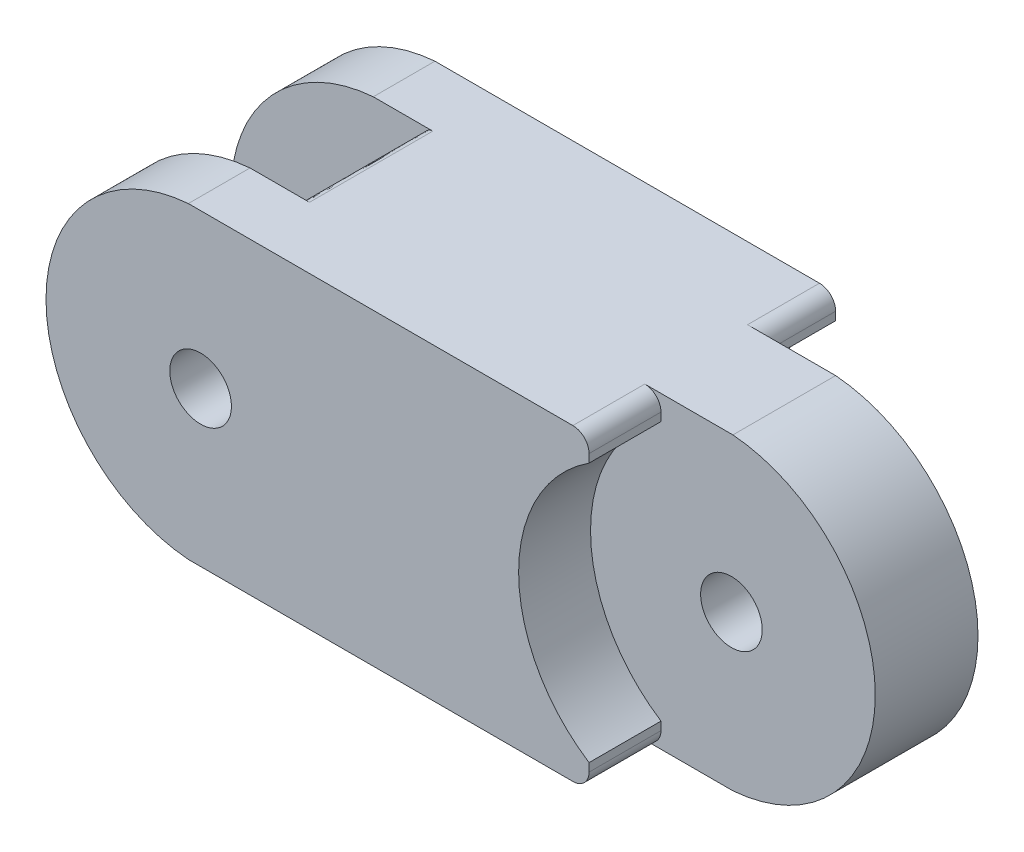
ISO-10303-21;
HEADER;
FILE_DESCRIPTION(('STEP AP214'),'2;1');
FILE_NAME('part.step','',(''),(''),'','','');
FILE_SCHEMA(('AUTOMOTIVE_DESIGN { 1 0 10303 214 1 1 1 1 }'));
ENDSEC;
DATA;
#1=APPLICATION_CONTEXT('core data for automotive mechanical design processes');
#2=APPLICATION_PROTOCOL_DEFINITION('international standard','automotive_design',2000,#1);
#3=PRODUCT_CONTEXT('',#1,'mechanical');
#4=PRODUCT('Part','Part','',(#3));
#5=PRODUCT_RELATED_PRODUCT_CATEGORY('part','',(#4));
#6=PRODUCT_DEFINITION_FORMATION('','',#4);
#7=PRODUCT_DEFINITION_CONTEXT('part definition',#1,'design');
#8=PRODUCT_DEFINITION('design','',#6,#7);
#9=PRODUCT_DEFINITION_SHAPE('','',#8);
#10=(LENGTH_UNIT() NAMED_UNIT(*) SI_UNIT(.MILLI.,.METRE.));
#11=(NAMED_UNIT(*) PLANE_ANGLE_UNIT() SI_UNIT($,.RADIAN.));
#12=(NAMED_UNIT(*) SI_UNIT($,.STERADIAN.) SOLID_ANGLE_UNIT());
#13=UNCERTAINTY_MEASURE_WITH_UNIT(LENGTH_MEASURE(1.E-05),#10,'distance_accuracy_value','');
#14=(GEOMETRIC_REPRESENTATION_CONTEXT(3) GLOBAL_UNCERTAINTY_ASSIGNED_CONTEXT((#13)) GLOBAL_UNIT_ASSIGNED_CONTEXT((#10,
#11,#12)) REPRESENTATION_CONTEXT('',''));
#15=CARTESIAN_POINT('',(0.,0.,0.));
#16=DIRECTION('',(0.,0.,1.));
#17=DIRECTION('',(1.,0.,0.));
#18=AXIS2_PLACEMENT_3D('',#15,#16,#17);
#19=CARTESIAN_POINT('',(-13.8483301079063,9.525,-7.62));
#20=DIRECTION('',(0.,0.,1.));
#21=DIRECTION('',(1.,0.,0.));
#22=AXIS2_PLACEMENT_3D('',#19,#20,#21);
#23=CYLINDRICAL_SURFACE('',#22,1.905);
#24=CARTESIAN_POINT('',(-13.8483301079063,9.525,7.62));
#25=DIRECTION('',(0.,0.,1.));
#26=DIRECTION('',(1.,0.,0.));
#27=AXIS2_PLACEMENT_3D('',#24,#25,#26);
#28=CIRCLE('',#27,1.905);
#29=CARTESIAN_POINT('',(-11.9433301079063,9.525,7.62));
#30=VERTEX_POINT('',#29);
#31=EDGE_CURVE('E646',#30,#30,#28,.T.);
#32=ORIENTED_EDGE('',*,*,#31,.T.);
#33=EDGE_LOOP('',(#32));
#34=FACE_BOUND('',#33,.T.);
#35=CARTESIAN_POINT('',(-13.8483301079063,9.525,3.81));
#36=DIRECTION('',(0.,0.,1.));
#37=DIRECTION('',(1.,0.,0.));
#38=AXIS2_PLACEMENT_3D('',#35,#36,#37);
#39=CIRCLE('',#38,1.905);
#40=CARTESIAN_POINT('',(-11.9433301079063,9.525,3.81));
#41=VERTEX_POINT('',#40);
#42=EDGE_CURVE('E444',#41,#41,#39,.T.);
#43=ORIENTED_EDGE('',*,*,#42,.F.);
#44=EDGE_LOOP('',(#43));
#45=FACE_BOUND('',#44,.T.);
#46=ADVANCED_FACE('F45',(#34,#45),#23,.F.);
#47=CARTESIAN_POINT('',(-14.605,19.05,-7.62));
#48=DIRECTION('',(0.,0.,-1.));
#49=DIRECTION('',(-1.,0.,0.));
#50=AXIS2_PLACEMENT_3D('',#47,#48,#49);
#51=PLANE('',#50);
#52=DIRECTION('',(0.,1.,0.));
#53=VECTOR('',#52,1.);
#54=CARTESIAN_POINT('',(10.16,-6.28617928474841,-7.62));
#55=LINE('',#54,#53);
#56=CARTESIAN_POINT('',(10.16,1.,-7.62));
#57=VERTEX_POINT('',#56);
#58=CARTESIAN_POINT('',(10.16,1.50996383917781,-7.62));
#59=VERTEX_POINT('',#58);
#60=EDGE_CURVE('E374',#57,#59,#55,.T.);
#61=ORIENTED_EDGE('',*,*,#60,.F.);
#62=CARTESIAN_POINT('',(9.16,1.,-7.62));
#63=DIRECTION('',(0.,0.,-1.));
#64=DIRECTION('',(-1.,0.,0.));
#65=AXIS2_PLACEMENT_3D('',#62,#63,#64);
#66=CIRCLE('',#65,1.);
#67=CARTESIAN_POINT('',(9.15999999999999,0.,-7.62));
#68=VERTEX_POINT('',#67);
#69=EDGE_CURVE('E402',#57,#68,#66,.T.);
#70=ORIENTED_EDGE('',*,*,#69,.T.);
#71=DIRECTION('',(1.,0.,0.));
#72=VECTOR('',#71,1.);
#73=CARTESIAN_POINT('',(-14.605,0.,-7.62));
#74=LINE('',#73,#72);
#75=CARTESIAN_POINT('',(-14.605,0.,-7.62));
#76=VERTEX_POINT('',#75);
#77=EDGE_CURVE('E235',#76,#68,#74,.T.);
#78=ORIENTED_EDGE('',*,*,#77,.F.);
#79=CARTESIAN_POINT('',(-13.8483301079063,9.525,-7.62));
#80=DIRECTION('',(0.,0.,1.));
#81=DIRECTION('',(1.,0.,0.));
#82=AXIS2_PLACEMENT_3D('',#79,#80,#81);
#83=CIRCLE('',#82,9.555007814);
#84=CARTESIAN_POINT('',(-14.605,19.05,-7.62));
#85=VERTEX_POINT('',#84);
#86=EDGE_CURVE('E434',#85,#76,#83,.T.);
#87=ORIENTED_EDGE('',*,*,#86,.F.);
#88=DIRECTION('',(1.,0.,0.));
#89=VECTOR('',#88,1.);
#90=CARTESIAN_POINT('',(-14.605,19.05,-7.62));
#91=LINE('',#90,#89);
#92=CARTESIAN_POINT('',(9.15999999999999,19.05,-7.62));
#93=VERTEX_POINT('',#92);
#94=EDGE_CURVE('E226',#85,#93,#91,.T.);
#95=ORIENTED_EDGE('',*,*,#94,.T.);
#96=CARTESIAN_POINT('',(9.16,18.05,-7.62));
#97=DIRECTION('',(0.,0.,-1.));
#98=DIRECTION('',(-1.,0.,0.));
#99=AXIS2_PLACEMENT_3D('',#96,#97,#98);
#100=CIRCLE('',#99,1.);
#101=CARTESIAN_POINT('',(10.16,18.05,-7.62));
#102=VERTEX_POINT('',#101);
#103=EDGE_CURVE('E400',#93,#102,#100,.T.);
#104=ORIENTED_EDGE('',*,*,#103,.T.);
#105=CARTESIAN_POINT('',(10.16,17.5400361608222,-7.62));
#106=VERTEX_POINT('',#105);
#107=EDGE_CURVE('E480',#106,#102,#55,.T.);
#108=ORIENTED_EDGE('',*,*,#107,.F.);
#109=CARTESIAN_POINT('',(15.3616698920937,9.525,-7.62));
#110=DIRECTION('',(0.,0.,-1.));
#111=DIRECTION('',(-1.,0.,0.));
#112=AXIS2_PLACEMENT_3D('',#109,#110,#111);
#113=CIRCLE('',#112,9.555007814);
#114=EDGE_CURVE('E651',#106,#59,#113,.F.);
#115=ORIENTED_EDGE('',*,*,#114,.T.);
#116=EDGE_LOOP('',(#61,#70,#78,#87,#95,#104,#108,#115));
#117=FACE_BOUND('',#116,.T.);
#118=CARTESIAN_POINT('',(-13.8483301079063,9.525,-7.62));
#119=DIRECTION('',(0.,0.,1.));
#120=DIRECTION('',(1.,0.,0.));
#121=AXIS2_PLACEMENT_3D('',#118,#119,#120);
#122=CIRCLE('',#121,1.905);
#123=CARTESIAN_POINT('',(-11.9433301079063,9.525,-7.62));
#124=VERTEX_POINT('',#123);
#125=EDGE_CURVE('E631',#124,#124,#122,.T.);
#126=ORIENTED_EDGE('',*,*,#125,.T.);
#127=EDGE_LOOP('',(#126));
#128=FACE_BOUND('',#127,.T.);
#129=ADVANCED_FACE('F269',(#117,#128),#51,.T.);
#130=CARTESIAN_POINT('',(-14.605,19.05,7.62));
#131=DIRECTION('',(0.,0.,-1.));
#132=DIRECTION('',(-1.,0.,0.));
#133=AXIS2_PLACEMENT_3D('',#130,#131,#132);
#134=PLANE('',#133);
#135=ORIENTED_EDGE('',*,*,#31,.F.);
#136=EDGE_LOOP('',(#135));
#137=FACE_BOUND('',#136,.T.);
#138=DIRECTION('',(1.,0.,0.));
#139=VECTOR('',#138,1.);
#140=CARTESIAN_POINT('',(-14.605,0.,7.62));
#141=LINE('',#140,#139);
#142=CARTESIAN_POINT('',(-14.605,0.,7.62));
#143=VERTEX_POINT('',#142);
#144=CARTESIAN_POINT('',(9.15999999999999,0.,7.62));
#145=VERTEX_POINT('',#144);
#146=EDGE_CURVE('E227',#143,#145,#141,.T.);
#147=ORIENTED_EDGE('',*,*,#146,.T.);
#148=CARTESIAN_POINT('',(9.16,1.,7.62));
#149=DIRECTION('',(0.,0.,-1.));
#150=DIRECTION('',(-1.,0.,0.));
#151=AXIS2_PLACEMENT_3D('',#148,#149,#150);
#152=CIRCLE('',#151,1.);
#153=CARTESIAN_POINT('',(10.16,1.,7.62));
#154=VERTEX_POINT('',#153);
#155=EDGE_CURVE('E394',#145,#154,#152,.F.);
#156=ORIENTED_EDGE('',*,*,#155,.T.);
#157=DIRECTION('',(0.,1.,0.));
#158=VECTOR('',#157,1.);
#159=CARTESIAN_POINT('',(10.16,-6.28617928474841,7.62));
#160=LINE('',#159,#158);
#161=CARTESIAN_POINT('',(10.16,1.50996383917781,7.62));
#162=VERTEX_POINT('',#161);
#163=EDGE_CURVE('E464',#154,#162,#160,.T.);
#164=ORIENTED_EDGE('',*,*,#163,.T.);
#165=CARTESIAN_POINT('',(15.3616698920937,9.525,7.62));
#166=DIRECTION('',(0.,0.,-1.));
#167=DIRECTION('',(-1.,0.,0.));
#168=AXIS2_PLACEMENT_3D('',#165,#166,#167);
#169=CIRCLE('',#168,9.555007814);
#170=CARTESIAN_POINT('',(10.16,17.5400361608222,7.62));
#171=VERTEX_POINT('',#170);
#172=EDGE_CURVE('E645',#162,#171,#169,.T.);
#173=ORIENTED_EDGE('',*,*,#172,.T.);
#174=CARTESIAN_POINT('',(10.16,18.05,7.62));
#175=VERTEX_POINT('',#174);
#176=EDGE_CURVE('E199',#171,#175,#160,.T.);
#177=ORIENTED_EDGE('',*,*,#176,.T.);
#178=CARTESIAN_POINT('',(9.16,18.05,7.62));
#179=DIRECTION('',(0.,0.,-1.));
#180=DIRECTION('',(-1.,0.,0.));
#181=AXIS2_PLACEMENT_3D('',#178,#179,#180);
#182=CIRCLE('',#181,1.);
#183=CARTESIAN_POINT('',(9.15999999999999,19.05,7.62));
#184=VERTEX_POINT('',#183);
#185=EDGE_CURVE('E392',#175,#184,#182,.F.);
#186=ORIENTED_EDGE('',*,*,#185,.T.);
#187=DIRECTION('',(1.,0.,0.));
#188=VECTOR('',#187,1.);
#189=CARTESIAN_POINT('',(-14.605,19.05,7.62));
#190=LINE('',#189,#188);
#191=CARTESIAN_POINT('',(-14.605,19.05,7.62));
#192=VERTEX_POINT('',#191);
#193=EDGE_CURVE('E230',#192,#184,#190,.T.);
#194=ORIENTED_EDGE('',*,*,#193,.F.);
#195=CARTESIAN_POINT('',(-13.8483301079063,9.525,7.62));
#196=DIRECTION('',(0.,0.,1.));
#197=DIRECTION('',(1.,0.,0.));
#198=AXIS2_PLACEMENT_3D('',#195,#196,#197);
#199=CIRCLE('',#198,9.555007814);
#200=EDGE_CURVE('E220',#192,#143,#199,.T.);
#201=ORIENTED_EDGE('',*,*,#200,.T.);
#202=EDGE_LOOP('',(#147,#156,#164,#173,#177,#186,#194,#201));
#203=FACE_BOUND('',#202,.T.);
#204=ADVANCED_FACE('F266',(#137,#203),#134,.F.);
#205=CARTESIAN_POINT('',(0.,19.05,0.));
#206=DIRECTION('',(0.,-1.,0.));
#207=DIRECTION('',(0.,0.,-1.));
#208=AXIS2_PLACEMENT_3D('',#205,#206,#207);
#209=PLANE('',#208);
#210=DIRECTION('',(1.,0.,0.));
#211=VECTOR('',#210,1.);
#212=CARTESIAN_POINT('',(14.605,19.05,-3.175));
#213=LINE('',#212,#211);
#214=CARTESIAN_POINT('',(9.16,19.05,-3.175));
#215=VERTEX_POINT('',#214);
#216=CARTESIAN_POINT('',(14.605,19.05,-3.175));
#217=VERTEX_POINT('',#216);
#218=EDGE_CURVE('E66',#215,#217,#213,.T.);
#219=ORIENTED_EDGE('',*,*,#218,.F.);
#220=DIRECTION('',(0.,0.,1.));
#221=VECTOR('',#220,1.);
#222=CARTESIAN_POINT('',(9.16,19.05,0.));
#223=LINE('',#222,#221);
#224=EDGE_CURVE('E408',#215,#93,#223,.F.);
#225=ORIENTED_EDGE('',*,*,#224,.T.);
#226=ORIENTED_EDGE('',*,*,#94,.F.);
#227=DIRECTION('',(0.,0.,1.));
#228=VECTOR('',#227,1.);
#229=CARTESIAN_POINT('',(-14.605,19.05,-7.62));
#230=LINE('',#229,#228);
#231=CARTESIAN_POINT('',(-14.605,19.05,-3.81));
#232=VERTEX_POINT('',#231);
#233=EDGE_CURVE('E441',#85,#232,#230,.T.);
#234=ORIENTED_EDGE('',*,*,#233,.T.);
#235=DIRECTION('',(1.,0.,0.));
#236=VECTOR('',#235,1.);
#237=CARTESIAN_POINT('',(-13.8483301079063,19.05,-3.81));
#238=LINE('',#237,#236);
#239=CARTESIAN_POINT('',(-10.9285494178001,19.05,-3.81));
#240=VERTEX_POINT('',#239);
#241=EDGE_CURVE('E543',#232,#240,#238,.T.);
#242=ORIENTED_EDGE('',*,*,#241,.T.);
#243=CARTESIAN_POINT('',(-10.9285494178001,19.05,4.191));
#244=CARTESIAN_POINT('',(-10.9285494178001,19.05,1.397));
#245=CARTESIAN_POINT('',(-10.9285494178001,19.05,-1.397));
#246=CARTESIAN_POINT('',(-10.9285494178001,19.05,-4.191));
#247=(BOUNDED_CURVE() B_SPLINE_CURVE(3,(#243,#244,#245,#246),.UNSPECIFIED.,.F.,
.F.) B_SPLINE_CURVE_WITH_KNOTS((4,4),(0.003429,0.011811),
.UNSPECIFIED.) CURVE() GEOMETRIC_REPRESENTATION_ITEM() RATIONAL_B_SPLINE_CURVE((1.,1.,1.,1.)) REPRESENTATION_ITEM(''));
#248=CARTESIAN_POINT('',(-10.9285494178001,19.05,3.81));
#249=VERTEX_POINT('',#248);
#250=EDGE_CURVE('E361',#240,#249,#247,.F.);
#251=ORIENTED_EDGE('',*,*,#250,.T.);
#252=DIRECTION('',(-1.,0.,0.));
#253=VECTOR('',#252,1.);
#254=CARTESIAN_POINT('',(0.,19.05,3.81));
#255=LINE('',#254,#253);
#256=CARTESIAN_POINT('',(-14.605,19.05,3.81));
#257=VERTEX_POINT('',#256);
#258=EDGE_CURVE('E534',#249,#257,#255,.T.);
#259=ORIENTED_EDGE('',*,*,#258,.T.);
#260=DIRECTION('',(0.,0.,-1.));
#261=VECTOR('',#260,1.);
#262=CARTESIAN_POINT('',(-14.605,19.05,7.62));
#263=LINE('',#262,#261);
#264=EDGE_CURVE('E223',#192,#257,#263,.T.);
#265=ORIENTED_EDGE('',*,*,#264,.F.);
#266=ORIENTED_EDGE('',*,*,#193,.T.);
#267=DIRECTION('',(0.,0.,1.));
#268=VECTOR('',#267,1.);
#269=CARTESIAN_POINT('',(9.16,19.05,0.));
#270=LINE('',#269,#268);
#271=CARTESIAN_POINT('',(9.16,19.05,3.175));
#272=VERTEX_POINT('',#271);
#273=EDGE_CURVE('E197',#184,#272,#270,.F.);
#274=ORIENTED_EDGE('',*,*,#273,.T.);
#275=DIRECTION('',(-1.,0.,0.));
#276=VECTOR('',#275,1.);
#277=CARTESIAN_POINT('',(10.16,19.05,3.175));
#278=LINE('',#277,#276);
#279=CARTESIAN_POINT('',(14.605,19.05,3.175));
#280=VERTEX_POINT('',#279);
#281=EDGE_CURVE('E190',#280,#272,#278,.T.);
#282=ORIENTED_EDGE('',*,*,#281,.F.);
#283=DIRECTION('',(0.,0.,-1.));
#284=VECTOR('',#283,1.);
#285=CARTESIAN_POINT('',(14.605,19.05,3.175));
#286=LINE('',#285,#284);
#287=EDGE_CURVE('E193',#280,#217,#286,.T.);
#288=ORIENTED_EDGE('',*,*,#287,.T.);
#289=EDGE_LOOP('',(#219,#225,#226,#234,#242,#251,#259,#265,#266,#274,#282,#288));
#290=FACE_BOUND('',#289,.T.);
#291=ADVANCED_FACE('F192',(#290),#209,.F.);
#292=CARTESIAN_POINT('',(0.,0.,0.));
#293=DIRECTION('',(0.,-1.,0.));
#294=DIRECTION('',(0.,0.,-1.));
#295=AXIS2_PLACEMENT_3D('',#292,#293,#294);
#296=PLANE('',#295);
#297=DIRECTION('',(-1.,0.,0.));
#298=VECTOR('',#297,1.);
#299=CARTESIAN_POINT('',(10.16,0.,3.175));
#300=LINE('',#299,#298);
#301=CARTESIAN_POINT('',(14.605,0.,3.175));
#302=VERTEX_POINT('',#301);
#303=CARTESIAN_POINT('',(9.16,0.,3.175));
#304=VERTEX_POINT('',#303);
#305=EDGE_CURVE('E213',#302,#304,#300,.T.);
#306=ORIENTED_EDGE('',*,*,#305,.T.);
#307=DIRECTION('',(0.,0.,1.));
#308=VECTOR('',#307,1.);
#309=CARTESIAN_POINT('',(9.16,0.,7.62));
#310=LINE('',#309,#308);
#311=EDGE_CURVE('E389',#304,#145,#310,.T.);
#312=ORIENTED_EDGE('',*,*,#311,.T.);
#313=ORIENTED_EDGE('',*,*,#146,.F.);
#314=DIRECTION('',(0.,0.,-1.));
#315=VECTOR('',#314,1.);
#316=CARTESIAN_POINT('',(-14.605,0.,7.62));
#317=LINE('',#316,#315);
#318=CARTESIAN_POINT('',(-14.605,0.,3.81));
#319=VERTEX_POINT('',#318);
#320=EDGE_CURVE('E208',#143,#319,#317,.T.);
#321=ORIENTED_EDGE('',*,*,#320,.T.);
#322=DIRECTION('',(1.,0.,0.));
#323=VECTOR('',#322,1.);
#324=CARTESIAN_POINT('',(-13.8483301079063,0.,3.81));
#325=LINE('',#324,#323);
#326=CARTESIAN_POINT('',(-10.9285494178001,0.,3.81));
#327=VERTEX_POINT('',#326);
#328=EDGE_CURVE('E242',#319,#327,#325,.T.);
#329=ORIENTED_EDGE('',*,*,#328,.T.);
#330=CARTESIAN_POINT('',(-10.9285494178001,0.,-4.191));
#331=CARTESIAN_POINT('',(-10.9285494178001,0.,-1.397));
#332=CARTESIAN_POINT('',(-10.9285494178001,0.,1.397));
#333=CARTESIAN_POINT('',(-10.9285494178001,0.,4.191));
#334=(BOUNDED_CURVE() B_SPLINE_CURVE(3,(#330,#331,#332,#333),.UNSPECIFIED.,.F.,
.F.) B_SPLINE_CURVE_WITH_KNOTS((4,4),(0.003429,0.011811),
.UNSPECIFIED.) CURVE() GEOMETRIC_REPRESENTATION_ITEM() RATIONAL_B_SPLINE_CURVE((1.,1.,1.,1.)) REPRESENTATION_ITEM(''));
#335=CARTESIAN_POINT('',(-10.9285494178001,0.,-3.81));
#336=VERTEX_POINT('',#335);
#337=EDGE_CURVE('E248',#327,#336,#334,.F.);
#338=ORIENTED_EDGE('',*,*,#337,.T.);
#339=DIRECTION('',(-1.,0.,0.));
#340=VECTOR('',#339,1.);
#341=CARTESIAN_POINT('',(0.,0.,-3.81));
#342=LINE('',#341,#340);
#343=CARTESIAN_POINT('',(-14.605,0.,-3.81));
#344=VERTEX_POINT('',#343);
#345=EDGE_CURVE('E634',#336,#344,#342,.T.);
#346=ORIENTED_EDGE('',*,*,#345,.T.);
#347=DIRECTION('',(0.,0.,1.));
#348=VECTOR('',#347,1.);
#349=CARTESIAN_POINT('',(-14.605,0.,-7.62));
#350=LINE('',#349,#348);
#351=EDGE_CURVE('E438',#76,#344,#350,.T.);
#352=ORIENTED_EDGE('',*,*,#351,.F.);
#353=ORIENTED_EDGE('',*,*,#77,.T.);
#354=DIRECTION('',(0.,0.,1.));
#355=VECTOR('',#354,1.);
#356=CARTESIAN_POINT('',(9.16,0.,-3.175));
#357=LINE('',#356,#355);
#358=CARTESIAN_POINT('',(9.16,0.,-3.175));
#359=VERTEX_POINT('',#358);
#360=EDGE_CURVE('E386',#68,#359,#357,.T.);
#361=ORIENTED_EDGE('',*,*,#360,.T.);
#362=DIRECTION('',(1.,0.,0.));
#363=VECTOR('',#362,1.);
#364=CARTESIAN_POINT('',(14.605,0.,-3.175));
#365=LINE('',#364,#363);
#366=CARTESIAN_POINT('',(14.605,0.,-3.175));
#367=VERTEX_POINT('',#366);
#368=EDGE_CURVE('E478',#359,#367,#365,.T.);
#369=ORIENTED_EDGE('',*,*,#368,.T.);
#370=DIRECTION('',(0.,0.,-1.));
#371=VECTOR('',#370,1.);
#372=CARTESIAN_POINT('',(14.605,0.,3.175));
#373=LINE('',#372,#371);
#374=EDGE_CURVE('E209',#302,#367,#373,.T.);
#375=ORIENTED_EDGE('',*,*,#374,.F.);
#376=EDGE_LOOP('',(#306,#312,#313,#321,#329,#338,#346,#352,#353,#361,#369,#375));
#377=FACE_BOUND('',#376,.T.);
#378=ADVANCED_FACE('F254',(#377),#296,.T.);
#379=CARTESIAN_POINT('',(13.8483301079063,9.525,3.175));
#380=DIRECTION('',(0.,0.,-1.));
#381=DIRECTION('',(-1.,0.,0.));
#382=AXIS2_PLACEMENT_3D('',#379,#380,#381);
#383=CYLINDRICAL_SURFACE('',#382,9.555007814);
#384=CARTESIAN_POINT('',(13.8483301079063,9.525,-3.175));
#385=DIRECTION('',(0.,0.,-1.));
#386=DIRECTION('',(-1.,0.,0.));
#387=AXIS2_PLACEMENT_3D('',#384,#385,#386);
#388=CIRCLE('',#387,9.555007814);
#389=EDGE_CURVE('E207',#217,#367,#388,.T.);
#390=ORIENTED_EDGE('',*,*,#389,.F.);
#391=ORIENTED_EDGE('',*,*,#287,.F.);
#392=CARTESIAN_POINT('',(13.8483301079063,9.525,3.175));
#393=DIRECTION('',(0.,0.,-1.));
#394=DIRECTION('',(-1.,0.,0.));
#395=AXIS2_PLACEMENT_3D('',#392,#393,#394);
#396=CIRCLE('',#395,9.555007814);
#397=EDGE_CURVE('E205',#280,#302,#396,.T.);
#398=ORIENTED_EDGE('',*,*,#397,.T.);
#399=ORIENTED_EDGE('',*,*,#374,.T.);
#400=EDGE_LOOP('',(#390,#391,#398,#399));
#401=FACE_BOUND('',#400,.T.);
#402=ADVANCED_FACE('F203',(#401),#383,.T.);
#403=CARTESIAN_POINT('',(13.8483301079063,9.525,3.175));
#404=DIRECTION('',(0.,0.,-1.));
#405=DIRECTION('',(-1.,0.,0.));
#406=AXIS2_PLACEMENT_3D('',#403,#404,#405);
#407=PLANE('',#406);
#408=CARTESIAN_POINT('',(14.5133379219063,9.525,3.175));
#409=DIRECTION('',(0.,0.,-1.));
#410=DIRECTION('',(-1.,0.,0.));
#411=AXIS2_PLACEMENT_3D('',#408,#409,#410);
#412=CIRCLE('',#411,1.905);
#413=CARTESIAN_POINT('',(12.6083379219063,9.525,3.175));
#414=VERTEX_POINT('',#413);
#415=EDGE_CURVE('E373',#414,#414,#412,.T.);
#416=ORIENTED_EDGE('',*,*,#415,.T.);
#417=EDGE_LOOP('',(#416));
#418=FACE_BOUND('',#417,.T.);
#419=ORIENTED_EDGE('',*,*,#397,.F.);
#420=ORIENTED_EDGE('',*,*,#281,.T.);
#421=CARTESIAN_POINT('',(9.16,18.05,3.175));
#422=DIRECTION('',(0.,0.,-1.));
#423=DIRECTION('',(-1.,0.,0.));
#424=AXIS2_PLACEMENT_3D('',#421,#422,#423);
#425=CIRCLE('',#424,1.);
#426=CARTESIAN_POINT('',(10.16,18.05,3.175));
#427=VERTEX_POINT('',#426);
#428=EDGE_CURVE('E12',#272,#427,#425,.T.);
#429=ORIENTED_EDGE('',*,*,#428,.T.);
#430=DIRECTION('',(0.,1.,0.));
#431=VECTOR('',#430,1.);
#432=CARTESIAN_POINT('',(10.16,-6.28617928474841,3.175));
#433=LINE('',#432,#431);
#434=CARTESIAN_POINT('',(10.16,17.5400361608222,3.175));
#435=VERTEX_POINT('',#434);
#436=EDGE_CURVE('E471',#435,#427,#433,.T.);
#437=ORIENTED_EDGE('',*,*,#436,.F.);
#438=CARTESIAN_POINT('',(15.3616698920937,9.525,3.175));
#439=DIRECTION('',(0.,0.,1.));
#440=DIRECTION('',(1.,0.,0.));
#441=AXIS2_PLACEMENT_3D('',#438,#439,#440);
#442=CIRCLE('',#441,9.555007814);
#443=CARTESIAN_POINT('',(10.16,1.50996383917781,3.175));
#444=VERTEX_POINT('',#443);
#445=EDGE_CURVE('E647',#435,#444,#442,.T.);
#446=ORIENTED_EDGE('',*,*,#445,.T.);
#447=CARTESIAN_POINT('',(10.16,1.,3.175));
#448=VERTEX_POINT('',#447);
#449=EDGE_CURVE('E475',#448,#444,#433,.T.);
#450=ORIENTED_EDGE('',*,*,#449,.F.);
#451=CARTESIAN_POINT('',(9.16,1.,3.175));
#452=DIRECTION('',(0.,0.,-1.));
#453=DIRECTION('',(-1.,0.,0.));
#454=AXIS2_PLACEMENT_3D('',#451,#452,#453);
#455=CIRCLE('',#454,1.);
#456=EDGE_CURVE('E413',#448,#304,#455,.T.);
#457=ORIENTED_EDGE('',*,*,#456,.T.);
#458=ORIENTED_EDGE('',*,*,#305,.F.);
#459=EDGE_LOOP('',(#419,#420,#429,#437,#446,#450,#457,#458));
#460=FACE_BOUND('',#459,.T.);
#461=ADVANCED_FACE('F211',(#418,#460),#407,.F.);
#462=CARTESIAN_POINT('',(13.8483301079063,9.525,-3.175));
#463=DIRECTION('',(0.,0.,-1.));
#464=DIRECTION('',(-1.,0.,0.));
#465=AXIS2_PLACEMENT_3D('',#462,#463,#464);
#466=PLANE('',#465);
#467=CARTESIAN_POINT('',(14.5133379219063,9.525,-3.175));
#468=DIRECTION('',(0.,0.,-1.));
#469=DIRECTION('',(-1.,0.,0.));
#470=AXIS2_PLACEMENT_3D('',#467,#468,#469);
#471=CIRCLE('',#470,1.905);
#472=CARTESIAN_POINT('',(12.6083379219063,9.525,-3.175));
#473=VERTEX_POINT('',#472);
#474=EDGE_CURVE('E365',#473,#473,#471,.T.);
#475=ORIENTED_EDGE('',*,*,#474,.F.);
#476=EDGE_LOOP('',(#475));
#477=FACE_BOUND('',#476,.T.);
#478=ORIENTED_EDGE('',*,*,#218,.T.);
#479=ORIENTED_EDGE('',*,*,#389,.T.);
#480=ORIENTED_EDGE('',*,*,#368,.F.);
#481=CARTESIAN_POINT('',(9.16,1.,-3.175));
#482=DIRECTION('',(0.,0.,-1.));
#483=DIRECTION('',(-1.,0.,0.));
#484=AXIS2_PLACEMENT_3D('',#481,#482,#483);
#485=CIRCLE('',#484,1.);
#486=CARTESIAN_POINT('',(10.16,1.,-3.175));
#487=VERTEX_POINT('',#486);
#488=EDGE_CURVE('E415',#359,#487,#485,.F.);
#489=ORIENTED_EDGE('',*,*,#488,.T.);
#490=DIRECTION('',(0.,1.,0.));
#491=VECTOR('',#490,1.);
#492=CARTESIAN_POINT('',(10.16,-6.28617928474841,-3.175));
#493=LINE('',#492,#491);
#494=CARTESIAN_POINT('',(10.16,1.5099638391778,-3.175));
#495=VERTEX_POINT('',#494);
#496=EDGE_CURVE('E481',#487,#495,#493,.T.);
#497=ORIENTED_EDGE('',*,*,#496,.T.);
#498=CARTESIAN_POINT('',(15.3616698920937,9.525,-3.175));
#499=DIRECTION('',(0.,0.,1.));
#500=DIRECTION('',(1.,0.,0.));
#501=AXIS2_PLACEMENT_3D('',#498,#499,#500);
#502=CIRCLE('',#501,9.555007814);
#503=CARTESIAN_POINT('',(10.16,17.5400361608222,-3.175));
#504=VERTEX_POINT('',#503);
#505=EDGE_CURVE('E496',#504,#495,#502,.T.);
#506=ORIENTED_EDGE('',*,*,#505,.F.);
#507=CARTESIAN_POINT('',(10.16,18.05,-3.175));
#508=VERTEX_POINT('',#507);
#509=EDGE_CURVE('E421',#504,#508,#493,.T.);
#510=ORIENTED_EDGE('',*,*,#509,.T.);
#511=CARTESIAN_POINT('',(9.16,18.05,-3.175));
#512=DIRECTION('',(0.,0.,-1.));
#513=DIRECTION('',(-1.,0.,0.));
#514=AXIS2_PLACEMENT_3D('',#511,#512,#513);
#515=CIRCLE('',#514,1.);
#516=EDGE_CURVE('E53',#508,#215,#515,.F.);
#517=ORIENTED_EDGE('',*,*,#516,.T.);
#518=EDGE_LOOP('',(#478,#479,#480,#489,#497,#506,#510,#517));
#519=FACE_BOUND('',#518,.T.);
#520=ADVANCED_FACE('F419',(#477,#519),#466,.T.);
#521=CARTESIAN_POINT('',(-13.8483301079063,9.525,3.81));
#522=DIRECTION('',(0.,0.,1.));
#523=DIRECTION('',(1.,0.,0.));
#524=AXIS2_PLACEMENT_3D('',#521,#522,#523);
#525=CYLINDRICAL_SURFACE('',#524,9.555007814);
#526=ORIENTED_EDGE('',*,*,#200,.F.);
#527=ORIENTED_EDGE('',*,*,#264,.T.);
#528=CARTESIAN_POINT('',(-13.8483301079063,9.525,3.81));
#529=DIRECTION('',(0.,0.,1.));
#530=DIRECTION('',(1.,0.,0.));
#531=AXIS2_PLACEMENT_3D('',#528,#529,#530);
#532=CIRCLE('',#531,9.555007814);
#533=EDGE_CURVE('E217',#257,#319,#532,.T.);
#534=ORIENTED_EDGE('',*,*,#533,.T.);
#535=ORIENTED_EDGE('',*,*,#320,.F.);
#536=EDGE_LOOP('',(#526,#527,#534,#535));
#537=FACE_BOUND('',#536,.T.);
#538=ADVANCED_FACE('F595',(#537),#525,.T.);
#539=CARTESIAN_POINT('',(-13.8483301079063,9.525,3.81));
#540=DIRECTION('',(0.,0.,1.));
#541=DIRECTION('',(1.,0.,0.));
#542=AXIS2_PLACEMENT_3D('',#539,#540,#541);
#543=PLANE('',#542);
#544=ORIENTED_EDGE('',*,*,#42,.T.);
#545=EDGE_LOOP('',(#544));
#546=FACE_BOUND('',#545,.T.);
#547=ORIENTED_EDGE('',*,*,#533,.F.);
#548=ORIENTED_EDGE('',*,*,#258,.F.);
#549=CARTESIAN_POINT('',(-11.1489928304905,18.1012186481131,3.81));
#550=CARTESIAN_POINT('',(-13.0805333222123,19.05,3.80999999999998));
#551=CARTESIAN_POINT('',(-10.9285494178001,19.05,3.81));
#552=(BOUNDED_CURVE() B_SPLINE_CURVE(2,(#549,#550,#551),.UNSPECIFIED.,.F.,
.F.) B_SPLINE_CURVE_WITH_KNOTS((3,3),(0.,1.),
.UNSPECIFIED.) CURVE() GEOMETRIC_REPRESENTATION_ITEM() RATIONAL_B_SPLINE_CURVE((1.,
0.226315373125921,1.)) REPRESENTATION_ITEM(''));
#553=CARTESIAN_POINT('',(-11.1489928304905,18.1012186481131,3.81));
#554=VERTEX_POINT('',#553);
#555=EDGE_CURVE('E350',#249,#554,#552,.F.);
#556=ORIENTED_EDGE('',*,*,#555,.T.);
#557=CARTESIAN_POINT('',(-15.3616698920937,9.525,3.81));
#558=DIRECTION('',(0.,0.,1.));
#559=DIRECTION('',(-1.,0.,0.));
#560=AXIS2_PLACEMENT_3D('',#557,#558,#559);
#561=CIRCLE('',#560,9.555007814);
#562=CARTESIAN_POINT('',(-11.1489928304905,0.948781351886875,3.81));
#563=VERTEX_POINT('',#562);
#564=EDGE_CURVE('E486',#563,#554,#561,.T.);
#565=ORIENTED_EDGE('',*,*,#564,.F.);
#566=CARTESIAN_POINT('',(-10.9285494178001,0.,3.81));
#567=CARTESIAN_POINT('',(-13.0805333222123,0.,3.80999999999998));
#568=CARTESIAN_POINT('',(-11.1489928304905,0.948781351886871,3.81));
#569=(BOUNDED_CURVE() B_SPLINE_CURVE(2,(#566,#567,#568),.UNSPECIFIED.,.F.,
.F.) B_SPLINE_CURVE_WITH_KNOTS((3,3),(0.,1.),
.UNSPECIFIED.) CURVE() GEOMETRIC_REPRESENTATION_ITEM() RATIONAL_B_SPLINE_CURVE((1.,
0.226315373125926,1.)) REPRESENTATION_ITEM(''));
#570=EDGE_CURVE('E639',#563,#327,#569,.F.);
#571=ORIENTED_EDGE('',*,*,#570,.T.);
#572=ORIENTED_EDGE('',*,*,#328,.F.);
#573=EDGE_LOOP('',(#547,#548,#556,#565,#571,#572));
#574=FACE_BOUND('',#573,.T.);
#575=ADVANCED_FACE('F586',(#546,#574),#543,.F.);
#576=CARTESIAN_POINT('',(-13.8483301079063,9.525,-7.62));
#577=DIRECTION('',(0.,0.,1.));
#578=DIRECTION('',(1.,0.,0.));
#579=AXIS2_PLACEMENT_3D('',#576,#577,#578);
#580=CYLINDRICAL_SURFACE('',#579,9.555007814);
#581=CARTESIAN_POINT('',(-13.8483301079063,9.525,-3.81));
#582=DIRECTION('',(0.,0.,1.));
#583=DIRECTION('',(1.,0.,0.));
#584=AXIS2_PLACEMENT_3D('',#581,#582,#583);
#585=CIRCLE('',#584,9.555007814);
#586=EDGE_CURVE('E439',#232,#344,#585,.T.);
#587=ORIENTED_EDGE('',*,*,#586,.F.);
#588=ORIENTED_EDGE('',*,*,#233,.F.);
#589=ORIENTED_EDGE('',*,*,#86,.T.);
#590=ORIENTED_EDGE('',*,*,#351,.T.);
#591=EDGE_LOOP('',(#587,#588,#589,#590));
#592=FACE_BOUND('',#591,.T.);
#593=ADVANCED_FACE('F567',(#592),#580,.T.);
#594=CARTESIAN_POINT('',(-13.8483301079063,9.525,-3.81));
#595=DIRECTION('',(0.,0.,1.));
#596=DIRECTION('',(1.,0.,0.));
#597=AXIS2_PLACEMENT_3D('',#594,#595,#596);
#598=PLANE('',#597);
#599=CARTESIAN_POINT('',(-13.8483301079063,9.525,-3.81));
#600=DIRECTION('',(0.,0.,1.));
#601=DIRECTION('',(1.,0.,0.));
#602=AXIS2_PLACEMENT_3D('',#599,#600,#601);
#603=CIRCLE('',#602,1.905);
#604=CARTESIAN_POINT('',(-11.9433301079063,9.525,-3.81));
#605=VERTEX_POINT('',#604);
#606=EDGE_CURVE('E232',#605,#605,#603,.T.);
#607=ORIENTED_EDGE('',*,*,#606,.F.);
#608=EDGE_LOOP('',(#607));
#609=FACE_BOUND('',#608,.T.);
#610=ORIENTED_EDGE('',*,*,#586,.T.);
#611=ORIENTED_EDGE('',*,*,#345,.F.);
#612=CARTESIAN_POINT('',(-11.1489928304905,0.948781351886873,-3.81));
#613=CARTESIAN_POINT('',(-13.0805333222123,0.,-3.81));
#614=CARTESIAN_POINT('',(-10.9285494178001,0.,-3.81));
#615=(BOUNDED_CURVE() B_SPLINE_CURVE(2,(#612,#613,#614),.UNSPECIFIED.,.F.,
.F.) B_SPLINE_CURVE_WITH_KNOTS((3,3),(0.,1.),
.UNSPECIFIED.) CURVE() GEOMETRIC_REPRESENTATION_ITEM() RATIONAL_B_SPLINE_CURVE((1.,
0.226315373125926,1.)) REPRESENTATION_ITEM(''));
#616=CARTESIAN_POINT('',(-11.1489928304905,0.948781351886875,-3.81));
#617=VERTEX_POINT('',#616);
#618=EDGE_CURVE('E545',#336,#617,#615,.F.);
#619=ORIENTED_EDGE('',*,*,#618,.T.);
#620=CARTESIAN_POINT('',(-15.3616698920937,9.525,-3.81));
#621=DIRECTION('',(0.,0.,1.));
#622=DIRECTION('',(-1.,0.,0.));
#623=AXIS2_PLACEMENT_3D('',#620,#621,#622);
#624=CIRCLE('',#623,9.555007814);
#625=CARTESIAN_POINT('',(-11.1489928304905,18.1012186481131,-3.81));
#626=VERTEX_POINT('',#625);
#627=EDGE_CURVE('E492',#617,#626,#624,.T.);
#628=ORIENTED_EDGE('',*,*,#627,.T.);
#629=CARTESIAN_POINT('',(-10.9285494178001,19.05,-3.81));
#630=CARTESIAN_POINT('',(-13.0805333222123,19.05,-3.81));
#631=CARTESIAN_POINT('',(-11.1489928304905,18.1012186481131,-3.81));
#632=(BOUNDED_CURVE() B_SPLINE_CURVE(2,(#629,#630,#631),.UNSPECIFIED.,.F.,
.F.) B_SPLINE_CURVE_WITH_KNOTS((3,3),(0.,1.),
.UNSPECIFIED.) CURVE() GEOMETRIC_REPRESENTATION_ITEM() RATIONAL_B_SPLINE_CURVE((1.,
0.226315373125921,1.)) REPRESENTATION_ITEM(''));
#633=EDGE_CURVE('E328',#626,#240,#632,.F.);
#634=ORIENTED_EDGE('',*,*,#633,.T.);
#635=ORIENTED_EDGE('',*,*,#241,.F.);
#636=EDGE_LOOP('',(#610,#611,#619,#628,#634,#635));
#637=FACE_BOUND('',#636,.T.);
#638=ADVANCED_FACE('F556',(#609,#637),#598,.T.);
#639=ORIENTED_EDGE('',*,*,#125,.F.);
#640=EDGE_LOOP('',(#639));
#641=FACE_BOUND('',#640,.T.);
#642=ORIENTED_EDGE('',*,*,#606,.T.);
#643=EDGE_LOOP('',(#642));
#644=FACE_BOUND('',#643,.T.);
#645=ADVANCED_FACE('F566',(#641,#644),#23,.F.);
#646=CARTESIAN_POINT('',(15.3616698920937,9.525,3.175));
#647=DIRECTION('',(0.,0.,1.));
#648=DIRECTION('',(1.,0.,0.));
#649=AXIS2_PLACEMENT_3D('',#646,#647,#648);
#650=CYLINDRICAL_SURFACE('',#649,9.555007814);
#651=ORIENTED_EDGE('',*,*,#172,.F.);
#652=DIRECTION('',(0.,0.,1.));
#653=VECTOR('',#652,1.);
#654=CARTESIAN_POINT('',(10.16,1.50996383917781,3.175));
#655=LINE('',#654,#653);
#656=EDGE_CURVE('E383',#162,#444,#655,.F.);
#657=ORIENTED_EDGE('',*,*,#656,.T.);
#658=ORIENTED_EDGE('',*,*,#445,.F.);
#659=DIRECTION('',(0.,0.,1.));
#660=VECTOR('',#659,1.);
#661=CARTESIAN_POINT('',(10.16,17.5400361608222,3.175));
#662=LINE('',#661,#660);
#663=EDGE_CURVE('E380',#435,#171,#662,.T.);
#664=ORIENTED_EDGE('',*,*,#663,.T.);
#665=EDGE_LOOP('',(#651,#657,#658,#664));
#666=FACE_BOUND('',#665,.T.);
#667=ADVANCED_FACE('F622',(#666),#650,.F.);
#668=CARTESIAN_POINT('',(15.3616698920937,9.525,-3.175));
#669=DIRECTION('',(0.,0.,-1.));
#670=DIRECTION('',(-1.,0.,0.));
#671=AXIS2_PLACEMENT_3D('',#668,#669,#670);
#672=CYLINDRICAL_SURFACE('',#671,9.555007814);
#673=DIRECTION('',(0.,0.,-1.));
#674=VECTOR('',#673,1.);
#675=CARTESIAN_POINT('',(10.16,17.5400361608222,-3.175));
#676=LINE('',#675,#674);
#677=EDGE_CURVE('E378',#504,#106,#676,.T.);
#678=ORIENTED_EDGE('',*,*,#677,.F.);
#679=ORIENTED_EDGE('',*,*,#505,.T.);
#680=DIRECTION('',(0.,0.,-1.));
#681=VECTOR('',#680,1.);
#682=CARTESIAN_POINT('',(10.16,1.5099638391778,-3.175));
#683=LINE('',#682,#681);
#684=EDGE_CURVE('E375',#59,#495,#683,.F.);
#685=ORIENTED_EDGE('',*,*,#684,.F.);
#686=ORIENTED_EDGE('',*,*,#114,.F.);
#687=EDGE_LOOP('',(#678,#679,#685,#686));
#688=FACE_BOUND('',#687,.T.);
#689=ADVANCED_FACE('F516',(#688),#672,.F.);
#690=CARTESIAN_POINT('',(-15.3616698920937,9.525,-3.81));
#691=DIRECTION('',(0.,0.,1.));
#692=DIRECTION('',(1.,0.,0.));
#693=AXIS2_PLACEMENT_3D('',#690,#691,#692);
#694=CYLINDRICAL_SURFACE('',#693,9.555007814);
#695=ORIENTED_EDGE('',*,*,#627,.F.);
#696=CARTESIAN_POINT('',(-11.1489928304905,0.948781351886873,4.191));
#697=CARTESIAN_POINT('',(-11.1489928304905,0.94878135188686,1.397));
#698=CARTESIAN_POINT('',(-11.1489928304905,0.948781351886873,-1.397));
#699=CARTESIAN_POINT('',(-11.1489928304905,0.948781351886873,-4.191));
#700=(BOUNDED_CURVE() B_SPLINE_CURVE(3,(#696,#697,#698,#699),.UNSPECIFIED.,.F.,
.F.) B_SPLINE_CURVE_WITH_KNOTS((4,4),(0.003429,0.011811),
.UNSPECIFIED.) CURVE() GEOMETRIC_REPRESENTATION_ITEM() RATIONAL_B_SPLINE_CURVE((1.,1.,1.,1.)) REPRESENTATION_ITEM(''));
#701=EDGE_CURVE('E315',#617,#563,#700,.F.);
#702=ORIENTED_EDGE('',*,*,#701,.T.);
#703=ORIENTED_EDGE('',*,*,#564,.T.);
#704=CARTESIAN_POINT('',(-11.1489928304905,18.1012186481131,-4.191));
#705=CARTESIAN_POINT('',(-11.1489928304905,18.1012186481131,-1.397));
#706=CARTESIAN_POINT('',(-11.1489928304905,18.1012186481131,1.397));
#707=CARTESIAN_POINT('',(-11.1489928304905,18.1012186481131,4.191));
#708=(BOUNDED_CURVE() B_SPLINE_CURVE(3,(#704,#705,#706,#707),.UNSPECIFIED.,.F.,
.F.) B_SPLINE_CURVE_WITH_KNOTS((4,4),(0.003429,0.011811),
.UNSPECIFIED.) CURVE() GEOMETRIC_REPRESENTATION_ITEM() RATIONAL_B_SPLINE_CURVE((1.,1.,1.,1.)) REPRESENTATION_ITEM(''));
#709=EDGE_CURVE('E340',#554,#626,#708,.F.);
#710=ORIENTED_EDGE('',*,*,#709,.T.);
#711=EDGE_LOOP('',(#695,#702,#703,#710));
#712=FACE_BOUND('',#711,.T.);
#713=ADVANCED_FACE('F280',(#712),#694,.F.);
#714=CARTESIAN_POINT('',(-10.9285494178001,0.,4.191));
#715=CARTESIAN_POINT('',(-10.9285494178001,0.,1.397));
#716=CARTESIAN_POINT('',(-10.9285494178001,0.,-1.397));
#717=CARTESIAN_POINT('',(-10.9285494178001,0.,-4.191));
#718=CARTESIAN_POINT('',(-13.0805333222123,0.,4.19099999999998));
#719=CARTESIAN_POINT('',(-13.0805333222123,0.,1.39699999999997));
#720=CARTESIAN_POINT('',(-13.0805333222123,0.,-1.39699999999999));
#721=CARTESIAN_POINT('',(-13.0805333222123,0.,-4.191));
#722=CARTESIAN_POINT('',(-11.1489928304905,0.948781351886873,4.191));
#723=CARTESIAN_POINT('',(-11.1489928304905,0.94878135188686,1.397));
#724=CARTESIAN_POINT('',(-11.1489928304905,0.948781351886873,-1.397));
#725=CARTESIAN_POINT('',(-11.1489928304905,0.948781351886873,-4.191));
#726=(BOUNDED_SURFACE() B_SPLINE_SURFACE(2,3,((#714,#715,#716,#717),(#718,#719,#720,#721),(#722,
#723,#724,#725)),.UNSPECIFIED.,.F.,.F.,.F.) B_SPLINE_SURFACE_WITH_KNOTS((3,3),(4,4),(0.,1.),
(0.003429,0.011811),
.UNSPECIFIED.) GEOMETRIC_REPRESENTATION_ITEM() RATIONAL_B_SPLINE_SURFACE(((1.,1.,1.,1.),
(0.226315373125926,0.226315373125926,0.226315373125926,0.226315373125926),(1.,1.,1.,1.))) REPRESENTATION_ITEM('') SURFACE());
#727=ORIENTED_EDGE('',*,*,#570,.F.);
#728=ORIENTED_EDGE('',*,*,#701,.F.);
#729=ORIENTED_EDGE('',*,*,#618,.F.);
#730=ORIENTED_EDGE('',*,*,#337,.F.);
#731=EDGE_LOOP('',(#727,#728,#729,#730));
#732=FACE_BOUND('',#731,.T.);
#733=ADVANCED_FACE('F274',(#732),#726,.T.);
#734=CARTESIAN_POINT('',(-11.1489928304905,18.1012186481131,4.191));
#735=CARTESIAN_POINT('',(-11.1489928304905,18.1012186481131,1.397));
#736=CARTESIAN_POINT('',(-11.1489928304905,18.1012186481131,-1.397));
#737=CARTESIAN_POINT('',(-11.1489928304905,18.1012186481131,-4.191));
#738=CARTESIAN_POINT('',(-13.0805333222123,19.05,4.19099999999998));
#739=CARTESIAN_POINT('',(-13.0805333222123,19.05,1.39699999999997));
#740=CARTESIAN_POINT('',(-13.0805333222123,19.05,-1.39699999999999));
#741=CARTESIAN_POINT('',(-13.0805333222123,19.05,-4.191));
#742=CARTESIAN_POINT('',(-10.9285494178001,19.05,4.191));
#743=CARTESIAN_POINT('',(-10.9285494178001,19.05,1.397));
#744=CARTESIAN_POINT('',(-10.9285494178001,19.05,-1.397));
#745=CARTESIAN_POINT('',(-10.9285494178001,19.05,-4.191));
#746=(BOUNDED_SURFACE() B_SPLINE_SURFACE(2,3,((#734,#735,#736,#737),(#738,#739,#740,#741),(#742,
#743,#744,#745)),.UNSPECIFIED.,.F.,.F.,.F.) B_SPLINE_SURFACE_WITH_KNOTS((3,3),(4,4),(0.,1.),
(0.003429,0.011811),
.UNSPECIFIED.) GEOMETRIC_REPRESENTATION_ITEM() RATIONAL_B_SPLINE_SURFACE(((1.,1.,1.,1.),
(0.226315373125921,0.226315373125921,0.226315373125921,0.226315373125921),(1.,1.,1.,1.))) REPRESENTATION_ITEM('') SURFACE());
#747=ORIENTED_EDGE('',*,*,#555,.F.);
#748=ORIENTED_EDGE('',*,*,#250,.F.);
#749=ORIENTED_EDGE('',*,*,#633,.F.);
#750=ORIENTED_EDGE('',*,*,#709,.F.);
#751=EDGE_LOOP('',(#747,#748,#749,#750));
#752=FACE_BOUND('',#751,.T.);
#753=ADVANCED_FACE('F279',(#752),#746,.T.);
#754=CARTESIAN_POINT('',(14.5133379219063,9.525,-7.62));
#755=DIRECTION('',(0.,0.,1.));
#756=DIRECTION('',(1.,0.,0.));
#757=AXIS2_PLACEMENT_3D('',#754,#755,#756);
#758=CYLINDRICAL_SURFACE('',#757,1.905);
#759=ORIENTED_EDGE('',*,*,#474,.T.);
#760=EDGE_LOOP('',(#759));
#761=FACE_BOUND('',#760,.T.);
#762=ORIENTED_EDGE('',*,*,#415,.F.);
#763=EDGE_LOOP('',(#762));
#764=FACE_BOUND('',#763,.T.);
#765=ADVANCED_FACE('F517',(#761,#764),#758,.F.);
#766=CARTESIAN_POINT('',(10.16,-6.28617928474841,-3.175));
#767=DIRECTION('',(-1.,0.,0.));
#768=DIRECTION('',(0.,0.,1.));
#769=AXIS2_PLACEMENT_3D('',#766,#767,#768);
#770=PLANE('',#769);
#771=ORIENTED_EDGE('',*,*,#496,.F.);
#772=DIRECTION('',(0.,0.,1.));
#773=VECTOR('',#772,1.);
#774=CARTESIAN_POINT('',(10.16,1.,-7.62));
#775=LINE('',#774,#773);
#776=EDGE_CURVE('E398',#487,#57,#775,.F.);
#777=ORIENTED_EDGE('',*,*,#776,.T.);
#778=ORIENTED_EDGE('',*,*,#60,.T.);
#779=ORIENTED_EDGE('',*,*,#684,.T.);
#780=EDGE_LOOP('',(#771,#777,#778,#779));
#781=FACE_BOUND('',#780,.T.);
#782=ADVANCED_FACE('F666',(#781),#770,.F.);
#783=ORIENTED_EDGE('',*,*,#107,.T.);
#784=DIRECTION('',(0.,0.,1.));
#785=VECTOR('',#784,1.);
#786=CARTESIAN_POINT('',(10.16,18.05,-3.175));
#787=LINE('',#786,#785);
#788=EDGE_CURVE('E404',#102,#508,#787,.T.);
#789=ORIENTED_EDGE('',*,*,#788,.T.);
#790=ORIENTED_EDGE('',*,*,#509,.F.);
#791=ORIENTED_EDGE('',*,*,#677,.T.);
#792=EDGE_LOOP('',(#783,#789,#790,#791));
#793=FACE_BOUND('',#792,.T.);
#794=ADVANCED_FACE('F683',(#793),#770,.F.);
#795=CARTESIAN_POINT('',(10.16,-6.28617928474841,7.62));
#796=DIRECTION('',(-1.,0.,0.));
#797=DIRECTION('',(0.,0.,1.));
#798=AXIS2_PLACEMENT_3D('',#795,#796,#797);
#799=PLANE('',#798);
#800=ORIENTED_EDGE('',*,*,#436,.T.);
#801=DIRECTION('',(0.,0.,1.));
#802=VECTOR('',#801,1.);
#803=CARTESIAN_POINT('',(10.16,18.05,7.62));
#804=LINE('',#803,#802);
#805=EDGE_CURVE('E410',#427,#175,#804,.T.);
#806=ORIENTED_EDGE('',*,*,#805,.T.);
#807=ORIENTED_EDGE('',*,*,#176,.F.);
#808=ORIENTED_EDGE('',*,*,#663,.F.);
#809=EDGE_LOOP('',(#800,#806,#807,#808));
#810=FACE_BOUND('',#809,.T.);
#811=ADVANCED_FACE('F643',(#810),#799,.F.);
#812=ORIENTED_EDGE('',*,*,#163,.F.);
#813=DIRECTION('',(0.,0.,1.));
#814=VECTOR('',#813,1.);
#815=CARTESIAN_POINT('',(10.16,1.,3.175));
#816=LINE('',#815,#814);
#817=EDGE_CURVE('E396',#154,#448,#816,.F.);
#818=ORIENTED_EDGE('',*,*,#817,.T.);
#819=ORIENTED_EDGE('',*,*,#449,.T.);
#820=ORIENTED_EDGE('',*,*,#656,.F.);
#821=EDGE_LOOP('',(#812,#818,#819,#820));
#822=FACE_BOUND('',#821,.T.);
#823=ADVANCED_FACE('F467',(#822),#799,.F.);
#824=CARTESIAN_POINT('',(9.16,1.,0.));
#825=DIRECTION('',(0.,0.,-1.));
#826=DIRECTION('',(-1.,0.,0.));
#827=AXIS2_PLACEMENT_3D('',#824,#825,#826);
#828=CYLINDRICAL_SURFACE('',#827,1.);
#829=ORIENTED_EDGE('',*,*,#456,.F.);
#830=ORIENTED_EDGE('',*,*,#817,.F.);
#831=ORIENTED_EDGE('',*,*,#155,.F.);
#832=ORIENTED_EDGE('',*,*,#311,.F.);
#833=EDGE_LOOP('',(#829,#830,#831,#832));
#834=FACE_BOUND('',#833,.T.);
#835=ADVANCED_FACE('F460',(#834),#828,.T.);
#836=CARTESIAN_POINT('',(9.16,1.,0.));
#837=DIRECTION('',(0.,0.,-1.));
#838=DIRECTION('',(-1.,0.,0.));
#839=AXIS2_PLACEMENT_3D('',#836,#837,#838);
#840=CYLINDRICAL_SURFACE('',#839,1.);
#841=ORIENTED_EDGE('',*,*,#69,.F.);
#842=ORIENTED_EDGE('',*,*,#776,.F.);
#843=ORIENTED_EDGE('',*,*,#488,.F.);
#844=ORIENTED_EDGE('',*,*,#360,.F.);
#845=EDGE_LOOP('',(#841,#842,#843,#844));
#846=FACE_BOUND('',#845,.T.);
#847=ADVANCED_FACE('F669',(#846),#840,.T.);
#848=CARTESIAN_POINT('',(9.16,18.05,-3.175));
#849=DIRECTION('',(0.,0.,1.));
#850=DIRECTION('',(1.,0.,0.));
#851=AXIS2_PLACEMENT_3D('',#848,#849,#850);
#852=CYLINDRICAL_SURFACE('',#851,1.);
#853=ORIENTED_EDGE('',*,*,#103,.F.);
#854=ORIENTED_EDGE('',*,*,#224,.F.);
#855=ORIENTED_EDGE('',*,*,#516,.F.);
#856=ORIENTED_EDGE('',*,*,#788,.F.);
#857=EDGE_LOOP('',(#853,#854,#855,#856));
#858=FACE_BOUND('',#857,.T.);
#859=ADVANCED_FACE('F425',(#858),#852,.T.);
#860=CARTESIAN_POINT('',(9.16,18.05,7.62));
#861=DIRECTION('',(0.,0.,1.));
#862=DIRECTION('',(1.,0.,0.));
#863=AXIS2_PLACEMENT_3D('',#860,#861,#862);
#864=CYLINDRICAL_SURFACE('',#863,1.);
#865=ORIENTED_EDGE('',*,*,#428,.F.);
#866=ORIENTED_EDGE('',*,*,#273,.F.);
#867=ORIENTED_EDGE('',*,*,#185,.F.);
#868=ORIENTED_EDGE('',*,*,#805,.F.);
#869=EDGE_LOOP('',(#865,#866,#867,#868));
#870=FACE_BOUND('',#869,.T.);
#871=ADVANCED_FACE('F47',(#870),#864,.T.);
#872=CLOSED_SHELL('',(#46,#129,#204,#291,#378,#402,#461,#520,#538,#575,#593,#638,#645,#667,#689,
#713,#733,#753,#765,#782,#794,#811,#823,#835,#847,#859,#871));
#873=MANIFOLD_SOLID_BREP('B2',#872);
#874=ADVANCED_BREP_SHAPE_REPRESENTATION('',(#18,#873),#14);
#875=SHAPE_DEFINITION_REPRESENTATION(#9,#874);
ENDSEC;
END-ISO-10303-21;
